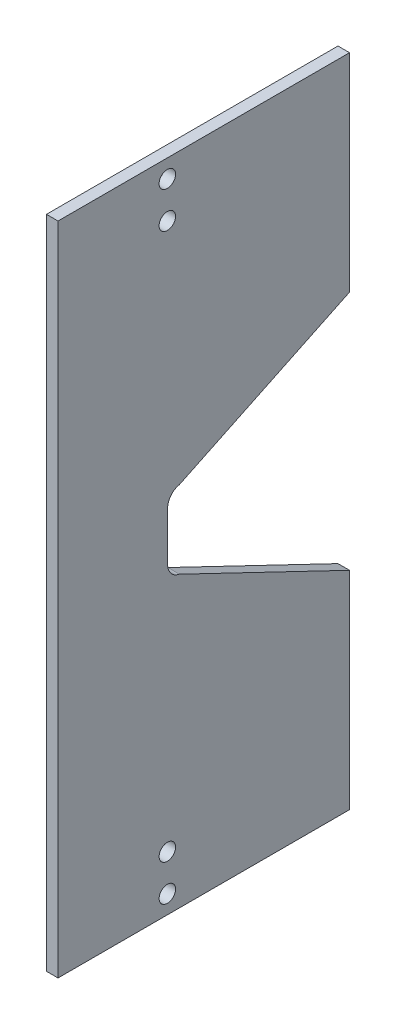
ISO-10303-21;
HEADER;
FILE_DESCRIPTION(('STEP AP214'),'2;1');
FILE_NAME('part.step','',(''),(''),'','','');
FILE_SCHEMA(('AUTOMOTIVE_DESIGN { 1 0 10303 214 1 1 1 1 }'));
ENDSEC;
DATA;
#1=APPLICATION_CONTEXT('core data for automotive mechanical design processes');
#2=APPLICATION_PROTOCOL_DEFINITION('international standard','automotive_design',2000,#1);
#3=PRODUCT_CONTEXT('',#1,'mechanical');
#4=PRODUCT('Part','Part','',(#3));
#5=PRODUCT_RELATED_PRODUCT_CATEGORY('part','',(#4));
#6=PRODUCT_DEFINITION_FORMATION('','',#4);
#7=PRODUCT_DEFINITION_CONTEXT('part definition',#1,'design');
#8=PRODUCT_DEFINITION('design','',#6,#7);
#9=PRODUCT_DEFINITION_SHAPE('','',#8);
#10=(LENGTH_UNIT() NAMED_UNIT(*) SI_UNIT(.MILLI.,.METRE.));
#11=(NAMED_UNIT(*) PLANE_ANGLE_UNIT() SI_UNIT($,.RADIAN.));
#12=(NAMED_UNIT(*) SI_UNIT($,.STERADIAN.) SOLID_ANGLE_UNIT());
#13=UNCERTAINTY_MEASURE_WITH_UNIT(LENGTH_MEASURE(1.E-05),#10,'distance_accuracy_value','');
#14=(GEOMETRIC_REPRESENTATION_CONTEXT(3) GLOBAL_UNCERTAINTY_ASSIGNED_CONTEXT((#13)) GLOBAL_UNIT_ASSIGNED_CONTEXT((#10,
#11,#12)) REPRESENTATION_CONTEXT('',''));
#15=CARTESIAN_POINT('',(0.,0.,0.));
#16=DIRECTION('',(0.,0.,1.));
#17=DIRECTION('',(1.,0.,0.));
#18=AXIS2_PLACEMENT_3D('',#15,#16,#17);
#19=CARTESIAN_POINT('',(0.794249999999998,-10.795,3.));
#20=DIRECTION('',(0.,1.,0.));
#21=DIRECTION('',(0.,0.,1.));
#22=AXIS2_PLACEMENT_3D('',#19,#20,#21);
#23=PLANE('',#22);
#24=DIRECTION('',(0.,0.,-1.));
#25=VECTOR('',#24,1.);
#26=CARTESIAN_POINT('',(-0.793750000000003,-10.795,3.));
#27=LINE('',#26,#25);
#28=CARTESIAN_POINT('',(-0.793750000000006,-10.795,15.));
#29=VERTEX_POINT('',#28);
#30=CARTESIAN_POINT('',(-0.793749999999994,-10.795,-25.));
#31=VERTEX_POINT('',#30);
#32=EDGE_CURVE('E181',#29,#31,#27,.T.);
#33=ORIENTED_EDGE('',*,*,#32,.F.);
#34=DIRECTION('',(-1.,0.,0.));
#35=VECTOR('',#34,1.);
#36=CARTESIAN_POINT('',(0.794249999999994,-10.795,15.));
#37=LINE('',#36,#35);
#38=CARTESIAN_POINT('',(0.794249999999994,-10.795,15.));
#39=VERTEX_POINT('',#38);
#40=EDGE_CURVE('E144',#39,#29,#37,.T.);
#41=ORIENTED_EDGE('',*,*,#40,.F.);
#42=DIRECTION('',(0.,0.,-1.));
#43=VECTOR('',#42,1.);
#44=CARTESIAN_POINT('',(0.794249999999998,-10.795,3.));
#45=LINE('',#44,#43);
#46=CARTESIAN_POINT('',(0.794250000000006,-10.795,-25.));
#47=VERTEX_POINT('',#46);
#48=EDGE_CURVE('E183',#39,#47,#45,.T.);
#49=ORIENTED_EDGE('',*,*,#48,.T.);
#50=DIRECTION('',(-1.,0.,0.));
#51=VECTOR('',#50,1.);
#52=CARTESIAN_POINT('',(0.794250000000006,-10.795,-25.));
#53=LINE('',#52,#51);
#54=EDGE_CURVE('E131',#47,#31,#53,.T.);
#55=ORIENTED_EDGE('',*,*,#54,.T.);
#56=EDGE_LOOP('',(#33,#41,#49,#55));
#57=FACE_BOUND('',#56,.T.);
#58=ADVANCED_FACE('F36',(#57),#23,.T.);
#59=CARTESIAN_POINT('',(0.794249999999998,-100.745,3.));
#60=DIRECTION('',(0.,-1.,0.));
#61=DIRECTION('',(0.,0.,-1.));
#62=AXIS2_PLACEMENT_3D('',#59,#60,#61);
#63=PLANE('',#62);
#64=DIRECTION('',(0.,0.,1.));
#65=VECTOR('',#64,1.);
#66=CARTESIAN_POINT('',(-0.793750000000003,-100.745,3.));
#67=LINE('',#66,#65);
#68=CARTESIAN_POINT('',(-0.793749999999994,-100.745,-25.));
#69=VERTEX_POINT('',#68);
#70=CARTESIAN_POINT('',(-0.793750000000006,-100.745,15.));
#71=VERTEX_POINT('',#70);
#72=EDGE_CURVE('E188',#69,#71,#67,.T.);
#73=ORIENTED_EDGE('',*,*,#72,.F.);
#74=DIRECTION('',(-1.,0.,0.));
#75=VECTOR('',#74,1.);
#76=CARTESIAN_POINT('',(0.794250000000006,-100.745,-25.));
#77=LINE('',#76,#75);
#78=CARTESIAN_POINT('',(0.794250000000006,-100.745,-25.));
#79=VERTEX_POINT('',#78);
#80=EDGE_CURVE('E136',#79,#69,#77,.T.);
#81=ORIENTED_EDGE('',*,*,#80,.F.);
#82=DIRECTION('',(0.,0.,1.));
#83=VECTOR('',#82,1.);
#84=CARTESIAN_POINT('',(0.794249999999998,-100.745,3.));
#85=LINE('',#84,#83);
#86=CARTESIAN_POINT('',(0.794249999999994,-100.745,15.));
#87=VERTEX_POINT('',#86);
#88=EDGE_CURVE('E180',#79,#87,#85,.T.);
#89=ORIENTED_EDGE('',*,*,#88,.T.);
#90=DIRECTION('',(-1.,0.,0.));
#91=VECTOR('',#90,1.);
#92=CARTESIAN_POINT('',(0.794249999999994,-100.745,15.));
#93=LINE('',#92,#91);
#94=EDGE_CURVE('E147',#87,#71,#93,.T.);
#95=ORIENTED_EDGE('',*,*,#94,.T.);
#96=EDGE_LOOP('',(#73,#81,#89,#95));
#97=FACE_BOUND('',#96,.T.);
#98=ADVANCED_FACE('F229',(#97),#63,.T.);
#99=CARTESIAN_POINT('',(0.794249999999999,-55.77,-0.0391447555514949));
#100=DIRECTION('',(0.,0.,-1.));
#101=DIRECTION('',(-1.,0.,0.));
#102=AXIS2_PLACEMENT_3D('',#99,#100,#101);
#103=PLANE('',#102);
#104=DIRECTION('',(0.,-1.,0.));
#105=VECTOR('',#104,1.);
#106=CARTESIAN_POINT('',(0.794249999999999,-55.77,-0.0391447555514949));
#107=LINE('',#106,#105);
#108=CARTESIAN_POINT('',(0.794249999999999,-52.4114543338415,-0.0391447555514953));
#109=VERTEX_POINT('',#108);
#110=CARTESIAN_POINT('',(0.794249999999999,-59.1285456661585,-0.0391447555514945));
#111=VERTEX_POINT('',#110);
#112=EDGE_CURVE('E177',#109,#111,#107,.T.);
#113=ORIENTED_EDGE('',*,*,#112,.T.);
#114=DIRECTION('',(-1.,0.,0.));
#115=VECTOR('',#114,1.);
#116=CARTESIAN_POINT('',(-0.793750000000002,-59.1285456661585,-0.0391447555514954));
#117=LINE('',#116,#115);
#118=CARTESIAN_POINT('',(-0.793750000000002,-59.1285456661585,-0.0391447555514954));
#119=VERTEX_POINT('',#118);
#120=EDGE_CURVE('E197',#111,#119,#117,.T.);
#121=ORIENTED_EDGE('',*,*,#120,.T.);
#122=DIRECTION('',(0.,-1.,0.));
#123=VECTOR('',#122,1.);
#124=CARTESIAN_POINT('',(-0.793750000000002,-55.77,-0.0391447555514954));
#125=LINE('',#124,#123);
#126=CARTESIAN_POINT('',(-0.793750000000002,-52.4114543338415,-0.0391447555514954));
#127=VERTEX_POINT('',#126);
#128=EDGE_CURVE('E174',#127,#119,#125,.T.);
#129=ORIENTED_EDGE('',*,*,#128,.F.);
#130=DIRECTION('',(-1.,0.,0.));
#131=VECTOR('',#130,1.);
#132=CARTESIAN_POINT('',(0.794249999999999,-52.4114543338415,-0.0391447555514949));
#133=LINE('',#132,#131);
#134=EDGE_CURVE('E192',#127,#109,#133,.F.);
#135=ORIENTED_EDGE('',*,*,#134,.T.);
#136=EDGE_LOOP('',(#113,#121,#129,#135));
#137=FACE_BOUND('',#136,.T.);
#138=ADVANCED_FACE('F241',(#137),#103,.T.);
#139=CARTESIAN_POINT('',(0.794250000000003,-12.795,-13.));
#140=DIRECTION('',(-1.,0.,0.));
#141=DIRECTION('',(0.,0.,1.));
#142=AXIS2_PLACEMENT_3D('',#139,#140,#141);
#143=PLANE('',#142);
#144=CARTESIAN_POINT('',(0.794249999999999,-52.4114543338415,-2.03914475555149));
#145=DIRECTION('',(-1.,0.,0.));
#146=DIRECTION('',(0.,0.,1.));
#147=AXIS2_PLACEMENT_3D('',#144,#145,#146);
#148=CIRCLE('',#147,2.);
#149=CARTESIAN_POINT('',(0.794249999999999,-50.4498612190227,-1.64907751532796));
#150=VERTEX_POINT('',#149);
#151=EDGE_CURVE('E124',#109,#150,#148,.T.);
#152=ORIENTED_EDGE('',*,*,#151,.T.);
#153=DIRECTION('',(0.,-0.432718299890711,0.901529185850182));
#154=VECTOR('',#153,1.);
#155=CARTESIAN_POINT('',(0.794249999999999,-50.4498612190227,-1.64907751532796));
#156=LINE('',#155,#154);
#157=CARTESIAN_POINT('',(0.794250000000006,-39.2418253206417,-25.));
#158=VERTEX_POINT('',#157);
#159=EDGE_CURVE('E111',#158,#150,#156,.T.);
#160=ORIENTED_EDGE('',*,*,#159,.F.);
#161=DIRECTION('',(0.,-1.,0.));
#162=VECTOR('',#161,1.);
#163=CARTESIAN_POINT('',(0.794250000000006,-10.795,-25.));
#164=LINE('',#163,#162);
#165=EDGE_CURVE('E121',#47,#158,#164,.T.);
#166=ORIENTED_EDGE('',*,*,#165,.F.);
#167=ORIENTED_EDGE('',*,*,#48,.F.);
#168=DIRECTION('',(0.,1.,0.));
#169=VECTOR('',#168,1.);
#170=CARTESIAN_POINT('',(0.794249999999994,-10.795,15.));
#171=LINE('',#170,#169);
#172=EDGE_CURVE('E141',#87,#39,#171,.T.);
#173=ORIENTED_EDGE('',*,*,#172,.F.);
#174=ORIENTED_EDGE('',*,*,#88,.F.);
#175=DIRECTION('',(0.,-1.,0.));
#176=VECTOR('',#175,1.);
#177=CARTESIAN_POINT('',(0.794250000000006,-65.7335226822871,-25.));
#178=LINE('',#177,#176);
#179=CARTESIAN_POINT('',(0.794250000000006,-72.2981746793583,-25.));
#180=VERTEX_POINT('',#179);
#181=EDGE_CURVE('E221',#180,#79,#178,.T.);
#182=ORIENTED_EDGE('',*,*,#181,.F.);
#183=DIRECTION('',(0.,-0.432718299890711,-0.901529185850182));
#184=VECTOR('',#183,1.);
#185=CARTESIAN_POINT('',(0.794249999999999,-61.0901387809773,-1.64907751532796));
#186=LINE('',#185,#184);
#187=CARTESIAN_POINT('',(0.794249999999999,-61.0901387809773,-1.64907751532796));
#188=VERTEX_POINT('',#187);
#189=EDGE_CURVE('E58',#188,#180,#186,.T.);
#190=ORIENTED_EDGE('',*,*,#189,.F.);
#191=CARTESIAN_POINT('',(0.794249999999999,-59.1285456661585,-2.03914475555149));
#192=DIRECTION('',(-1.,0.,0.));
#193=DIRECTION('',(0.,0.,1.));
#194=AXIS2_PLACEMENT_3D('',#191,#192,#193);
#195=CIRCLE('',#194,2.);
#196=EDGE_CURVE('E205',#188,#111,#195,.T.);
#197=ORIENTED_EDGE('',*,*,#196,.T.);
#198=ORIENTED_EDGE('',*,*,#112,.F.);
#199=EDGE_LOOP('',(#152,#160,#166,#167,#173,#174,#182,#190,#197,#198));
#200=FACE_BOUND('',#199,.T.);
#201=CARTESIAN_POINT('',(0.794249999999999,-93.245,0.));
#202=DIRECTION('',(-1.,0.,0.));
#203=DIRECTION('',(0.,0.,1.));
#204=AXIS2_PLACEMENT_3D('',#201,#202,#203);
#205=CIRCLE('',#204,1.1303);
#206=CARTESIAN_POINT('',(0.794249999999998,-93.245,1.1303));
#207=VERTEX_POINT('',#206);
#208=EDGE_CURVE('E153',#207,#207,#205,.T.);
#209=ORIENTED_EDGE('',*,*,#208,.T.);
#210=EDGE_LOOP('',(#209));
#211=FACE_BOUND('',#210,.T.);
#212=CARTESIAN_POINT('',(0.794249999999999,-98.245,0.));
#213=DIRECTION('',(-1.,0.,0.));
#214=DIRECTION('',(0.,0.,1.));
#215=AXIS2_PLACEMENT_3D('',#212,#213,#214);
#216=CIRCLE('',#215,1.1303);
#217=CARTESIAN_POINT('',(0.794249999999998,-98.245,1.1303));
#218=VERTEX_POINT('',#217);
#219=EDGE_CURVE('E159',#218,#218,#216,.T.);
#220=ORIENTED_EDGE('',*,*,#219,.T.);
#221=EDGE_LOOP('',(#220));
#222=FACE_BOUND('',#221,.T.);
#223=CARTESIAN_POINT('',(0.794249999999999,-13.295,0.));
#224=DIRECTION('',(-1.,0.,0.));
#225=DIRECTION('',(0.,0.,-1.));
#226=AXIS2_PLACEMENT_3D('',#223,#224,#225);
#227=CIRCLE('',#226,1.1303);
#228=CARTESIAN_POINT('',(0.794249999999999,-13.295,-1.1303));
#229=VERTEX_POINT('',#228);
#230=EDGE_CURVE('E165',#229,#229,#227,.T.);
#231=ORIENTED_EDGE('',*,*,#230,.T.);
#232=EDGE_LOOP('',(#231));
#233=FACE_BOUND('',#232,.T.);
#234=CARTESIAN_POINT('',(0.794249999999999,-18.295,0.));
#235=DIRECTION('',(-1.,0.,0.));
#236=DIRECTION('',(0.,0.,-1.));
#237=AXIS2_PLACEMENT_3D('',#234,#235,#236);
#238=CIRCLE('',#237,1.1303);
#239=CARTESIAN_POINT('',(0.794249999999999,-18.295,-1.1303));
#240=VERTEX_POINT('',#239);
#241=EDGE_CURVE('E171',#240,#240,#238,.T.);
#242=ORIENTED_EDGE('',*,*,#241,.T.);
#243=EDGE_LOOP('',(#242));
#244=FACE_BOUND('',#243,.T.);
#245=ADVANCED_FACE('F119',(#200,#211,#222,#233,#244),#143,.F.);
#246=CARTESIAN_POINT('',(-0.793749999999998,-12.795,-13.));
#247=DIRECTION('',(-1.,0.,0.));
#248=DIRECTION('',(0.,0.,1.));
#249=AXIS2_PLACEMENT_3D('',#246,#247,#248);
#250=PLANE('',#249);
#251=DIRECTION('',(0.,0.432718299890711,-0.901529185850183));
#252=VECTOR('',#251,1.);
#253=CARTESIAN_POINT('',(-0.793749999999994,-38.9710842723718,-25.5640643274959));
#254=LINE('',#253,#252);
#255=CARTESIAN_POINT('',(-0.793750000000001,-50.4498612190227,-1.64907751532796));
#256=VERTEX_POINT('',#255);
#257=CARTESIAN_POINT('',(-0.793749999999994,-39.2418253206417,-25.));
#258=VERTEX_POINT('',#257);
#259=EDGE_CURVE('E50',#256,#258,#254,.T.);
#260=ORIENTED_EDGE('',*,*,#259,.F.);
#261=CARTESIAN_POINT('',(-0.793750000000001,-52.4114543338415,-2.03914475555149));
#262=DIRECTION('',(-1.,0.,0.));
#263=DIRECTION('',(0.,0.,1.));
#264=AXIS2_PLACEMENT_3D('',#261,#262,#263);
#265=CIRCLE('',#264,2.);
#266=EDGE_CURVE('E194',#256,#127,#265,.F.);
#267=ORIENTED_EDGE('',*,*,#266,.T.);
#268=ORIENTED_EDGE('',*,*,#128,.T.);
#269=CARTESIAN_POINT('',(-0.793750000000001,-59.1285456661585,-2.03914475555149));
#270=DIRECTION('',(-1.,0.,0.));
#271=DIRECTION('',(0.,0.,1.));
#272=AXIS2_PLACEMENT_3D('',#269,#270,#271);
#273=CIRCLE('',#272,2.);
#274=CARTESIAN_POINT('',(-0.793750000000001,-61.0901387809773,-1.64907751532796));
#275=VERTEX_POINT('',#274);
#276=EDGE_CURVE('E202',#119,#275,#273,.F.);
#277=ORIENTED_EDGE('',*,*,#276,.T.);
#278=DIRECTION('',(0.,0.432718299890711,0.901529185850182));
#279=VECTOR('',#278,1.);
#280=CARTESIAN_POINT('',(-0.793750000000004,-56.4751970567948,7.96573345152746));
#281=LINE('',#280,#279);
#282=CARTESIAN_POINT('',(-0.793749999999994,-72.2981746793583,-25.));
#283=VERTEX_POINT('',#282);
#284=EDGE_CURVE('E126',#283,#275,#281,.T.);
#285=ORIENTED_EDGE('',*,*,#284,.F.);
#286=DIRECTION('',(0.,-1.,0.));
#287=VECTOR('',#286,1.);
#288=CARTESIAN_POINT('',(-0.793749999999994,-65.7335226822871,-25.));
#289=LINE('',#288,#287);
#290=EDGE_CURVE('E214',#283,#69,#289,.T.);
#291=ORIENTED_EDGE('',*,*,#290,.T.);
#292=ORIENTED_EDGE('',*,*,#72,.T.);
#293=DIRECTION('',(0.,1.,0.));
#294=VECTOR('',#293,1.);
#295=CARTESIAN_POINT('',(-0.793750000000006,-10.795,15.));
#296=LINE('',#295,#294);
#297=EDGE_CURVE('E134',#71,#29,#296,.T.);
#298=ORIENTED_EDGE('',*,*,#297,.T.);
#299=ORIENTED_EDGE('',*,*,#32,.T.);
#300=DIRECTION('',(0.,-1.,0.));
#301=VECTOR('',#300,1.);
#302=CARTESIAN_POINT('',(-0.793749999999994,-10.795,-25.));
#303=LINE('',#302,#301);
#304=EDGE_CURVE('E132',#31,#258,#303,.T.);
#305=ORIENTED_EDGE('',*,*,#304,.T.);
#306=EDGE_LOOP('',(#260,#267,#268,#277,#285,#291,#292,#298,#299,#305));
#307=FACE_BOUND('',#306,.T.);
#308=CARTESIAN_POINT('',(-0.793750000000002,-93.245,0.));
#309=DIRECTION('',(-1.,0.,0.));
#310=DIRECTION('',(0.,0.,1.));
#311=AXIS2_PLACEMENT_3D('',#308,#309,#310);
#312=CIRCLE('',#311,1.1303);
#313=CARTESIAN_POINT('',(-0.793750000000002,-93.245,1.1303));
#314=VERTEX_POINT('',#313);
#315=EDGE_CURVE('E150',#314,#314,#312,.T.);
#316=ORIENTED_EDGE('',*,*,#315,.F.);
#317=EDGE_LOOP('',(#316));
#318=FACE_BOUND('',#317,.T.);
#319=CARTESIAN_POINT('',(-0.793750000000002,-98.245,0.));
#320=DIRECTION('',(-1.,0.,0.));
#321=DIRECTION('',(0.,0.,1.));
#322=AXIS2_PLACEMENT_3D('',#319,#320,#321);
#323=CIRCLE('',#322,1.1303);
#324=CARTESIAN_POINT('',(-0.793750000000002,-98.245,1.1303));
#325=VERTEX_POINT('',#324);
#326=EDGE_CURVE('E156',#325,#325,#323,.T.);
#327=ORIENTED_EDGE('',*,*,#326,.F.);
#328=EDGE_LOOP('',(#327));
#329=FACE_BOUND('',#328,.T.);
#330=CARTESIAN_POINT('',(-0.793750000000002,-13.295,0.));
#331=DIRECTION('',(-1.,0.,0.));
#332=DIRECTION('',(0.,0.,-1.));
#333=AXIS2_PLACEMENT_3D('',#330,#331,#332);
#334=CIRCLE('',#333,1.1303);
#335=CARTESIAN_POINT('',(-0.793750000000001,-13.295,-1.1303));
#336=VERTEX_POINT('',#335);
#337=EDGE_CURVE('E162',#336,#336,#334,.T.);
#338=ORIENTED_EDGE('',*,*,#337,.F.);
#339=EDGE_LOOP('',(#338));
#340=FACE_BOUND('',#339,.T.);
#341=CARTESIAN_POINT('',(-0.793750000000002,-18.295,0.));
#342=DIRECTION('',(-1.,0.,0.));
#343=DIRECTION('',(0.,0.,-1.));
#344=AXIS2_PLACEMENT_3D('',#341,#342,#343);
#345=CIRCLE('',#344,1.1303);
#346=CARTESIAN_POINT('',(-0.793750000000001,-18.295,-1.1303));
#347=VERTEX_POINT('',#346);
#348=EDGE_CURVE('E168',#347,#347,#345,.T.);
#349=ORIENTED_EDGE('',*,*,#348,.F.);
#350=EDGE_LOOP('',(#349));
#351=FACE_BOUND('',#350,.T.);
#352=ADVANCED_FACE('F212',(#307,#318,#329,#340,#351),#250,.T.);
#353=CARTESIAN_POINT('',(0.794249999999999,-18.295,0.));
#354=DIRECTION('',(-1.,0.,0.));
#355=DIRECTION('',(0.,0.,1.));
#356=AXIS2_PLACEMENT_3D('',#353,#354,#355);
#357=CYLINDRICAL_SURFACE('',#356,1.1303);
#358=ORIENTED_EDGE('',*,*,#241,.F.);
#359=EDGE_LOOP('',(#358));
#360=FACE_BOUND('',#359,.T.);
#361=ORIENTED_EDGE('',*,*,#348,.T.);
#362=EDGE_LOOP('',(#361));
#363=FACE_BOUND('',#362,.T.);
#364=ADVANCED_FACE('F268',(#360,#363),#357,.F.);
#365=CARTESIAN_POINT('',(0.794249999999999,-13.295,0.));
#366=DIRECTION('',(-1.,0.,0.));
#367=DIRECTION('',(0.,0.,1.));
#368=AXIS2_PLACEMENT_3D('',#365,#366,#367);
#369=CYLINDRICAL_SURFACE('',#368,1.1303);
#370=ORIENTED_EDGE('',*,*,#230,.F.);
#371=EDGE_LOOP('',(#370));
#372=FACE_BOUND('',#371,.T.);
#373=ORIENTED_EDGE('',*,*,#337,.T.);
#374=EDGE_LOOP('',(#373));
#375=FACE_BOUND('',#374,.T.);
#376=ADVANCED_FACE('F272',(#372,#375),#369,.F.);
#377=CARTESIAN_POINT('',(0.794249999999999,-98.245,0.));
#378=DIRECTION('',(-1.,0.,0.));
#379=DIRECTION('',(0.,0.,1.));
#380=AXIS2_PLACEMENT_3D('',#377,#378,#379);
#381=CYLINDRICAL_SURFACE('',#380,1.1303);
#382=ORIENTED_EDGE('',*,*,#219,.F.);
#383=EDGE_LOOP('',(#382));
#384=FACE_BOUND('',#383,.T.);
#385=ORIENTED_EDGE('',*,*,#326,.T.);
#386=EDGE_LOOP('',(#385));
#387=FACE_BOUND('',#386,.T.);
#388=ADVANCED_FACE('F276',(#384,#387),#381,.F.);
#389=CARTESIAN_POINT('',(0.794249999999999,-93.245,0.));
#390=DIRECTION('',(-1.,0.,0.));
#391=DIRECTION('',(0.,0.,1.));
#392=AXIS2_PLACEMENT_3D('',#389,#390,#391);
#393=CYLINDRICAL_SURFACE('',#392,1.1303);
#394=ORIENTED_EDGE('',*,*,#208,.F.);
#395=EDGE_LOOP('',(#394));
#396=FACE_BOUND('',#395,.T.);
#397=ORIENTED_EDGE('',*,*,#315,.T.);
#398=EDGE_LOOP('',(#397));
#399=FACE_BOUND('',#398,.T.);
#400=ADVANCED_FACE('F251',(#396,#399),#393,.F.);
#401=CARTESIAN_POINT('',(0.794249999999999,-52.4114543338415,-2.03914475555149));
#402=DIRECTION('',(1.,0.,0.));
#403=DIRECTION('',(0.,0.,-1.));
#404=AXIS2_PLACEMENT_3D('',#401,#402,#403);
#405=CYLINDRICAL_SURFACE('',#404,2.);
#406=ORIENTED_EDGE('',*,*,#151,.F.);
#407=ORIENTED_EDGE('',*,*,#134,.F.);
#408=ORIENTED_EDGE('',*,*,#266,.F.);
#409=DIRECTION('',(-1.,0.,0.));
#410=VECTOR('',#409,1.);
#411=CARTESIAN_POINT('',(-0.793750000000001,-50.4498612190227,-1.64907751532796));
#412=LINE('',#411,#410);
#413=EDGE_CURVE('E185',#150,#256,#412,.T.);
#414=ORIENTED_EDGE('',*,*,#413,.F.);
#415=EDGE_LOOP('',(#406,#407,#408,#414));
#416=FACE_BOUND('',#415,.T.);
#417=ADVANCED_FACE('F239',(#416),#405,.F.);
#418=CARTESIAN_POINT('',(0.794249999999999,-59.1285456661585,-2.03914475555149));
#419=DIRECTION('',(1.,0.,0.));
#420=DIRECTION('',(0.,0.,-1.));
#421=AXIS2_PLACEMENT_3D('',#418,#419,#420);
#422=CYLINDRICAL_SURFACE('',#421,2.);
#423=ORIENTED_EDGE('',*,*,#196,.F.);
#424=DIRECTION('',(-1.,0.,0.));
#425=VECTOR('',#424,1.);
#426=CARTESIAN_POINT('',(0.794249999999999,-61.0901387809773,-1.64907751532796));
#427=LINE('',#426,#425);
#428=EDGE_CURVE('E200',#275,#188,#427,.F.);
#429=ORIENTED_EDGE('',*,*,#428,.F.);
#430=ORIENTED_EDGE('',*,*,#276,.F.);
#431=ORIENTED_EDGE('',*,*,#120,.F.);
#432=EDGE_LOOP('',(#423,#429,#430,#431));
#433=FACE_BOUND('',#432,.T.);
#434=ADVANCED_FACE('F38',(#433),#422,.F.);
#435=CARTESIAN_POINT('',(0.794249999999994,-10.795,15.));
#436=DIRECTION('',(0.,0.,1.));
#437=DIRECTION('',(1.,0.,0.));
#438=AXIS2_PLACEMENT_3D('',#435,#436,#437);
#439=PLANE('',#438);
#440=ORIENTED_EDGE('',*,*,#297,.F.);
#441=ORIENTED_EDGE('',*,*,#94,.F.);
#442=ORIENTED_EDGE('',*,*,#172,.T.);
#443=ORIENTED_EDGE('',*,*,#40,.T.);
#444=EDGE_LOOP('',(#440,#441,#442,#443));
#445=FACE_BOUND('',#444,.T.);
#446=ADVANCED_FACE('F232',(#445),#439,.T.);
#447=CARTESIAN_POINT('',(0.794250000000006,-10.795,-25.));
#448=DIRECTION('',(0.,0.,-1.));
#449=DIRECTION('',(-1.,0.,0.));
#450=AXIS2_PLACEMENT_3D('',#447,#448,#449);
#451=PLANE('',#450);
#452=DIRECTION('',(1.,0.,0.));
#453=VECTOR('',#452,1.);
#454=CARTESIAN_POINT('',(0.794250000000006,-39.2418253206417,-25.));
#455=LINE('',#454,#453);
#456=EDGE_CURVE('E11',#258,#158,#455,.T.);
#457=ORIENTED_EDGE('',*,*,#456,.F.);
#458=ORIENTED_EDGE('',*,*,#304,.F.);
#459=ORIENTED_EDGE('',*,*,#54,.F.);
#460=ORIENTED_EDGE('',*,*,#165,.T.);
#461=EDGE_LOOP('',(#457,#458,#459,#460));
#462=FACE_BOUND('',#461,.T.);
#463=ADVANCED_FACE('F129',(#462),#451,.T.);
#464=CARTESIAN_POINT('',(0.794250000000006,-65.7335226822871,-25.));
#465=DIRECTION('',(0.,0.,-1.));
#466=DIRECTION('',(-1.,0.,0.));
#467=AXIS2_PLACEMENT_3D('',#464,#465,#466);
#468=PLANE('',#467);
#469=DIRECTION('',(-1.,0.,0.));
#470=VECTOR('',#469,1.);
#471=CARTESIAN_POINT('',(0.794250000000006,-72.2981746793583,-25.));
#472=LINE('',#471,#470);
#473=EDGE_CURVE('E44',#180,#283,#472,.T.);
#474=ORIENTED_EDGE('',*,*,#473,.F.);
#475=ORIENTED_EDGE('',*,*,#181,.T.);
#476=ORIENTED_EDGE('',*,*,#80,.T.);
#477=ORIENTED_EDGE('',*,*,#290,.F.);
#478=EDGE_LOOP('',(#474,#475,#476,#477));
#479=FACE_BOUND('',#478,.T.);
#480=ADVANCED_FACE('F219',(#479),#468,.T.);
#481=CARTESIAN_POINT('',(-9.20575,-61.0901387809773,-1.64907751532796));
#482=DIRECTION('',(0.,-0.901529185850182,0.432718299890711));
#483=DIRECTION('',(0.,-0.432718299890711,-0.901529185850182));
#484=AXIS2_PLACEMENT_3D('',#481,#482,#483);
#485=PLANE('',#484);
#486=ORIENTED_EDGE('',*,*,#284,.T.);
#487=ORIENTED_EDGE('',*,*,#428,.T.);
#488=ORIENTED_EDGE('',*,*,#189,.T.);
#489=ORIENTED_EDGE('',*,*,#473,.T.);
#490=EDGE_LOOP('',(#486,#487,#488,#489));
#491=FACE_BOUND('',#490,.T.);
#492=ADVANCED_FACE('F207',(#491),#485,.F.);
#493=CARTESIAN_POINT('',(-9.20575,-50.4498612190227,-1.64907751532796));
#494=DIRECTION('',(0.,0.901529185850182,0.432718299890711));
#495=DIRECTION('',(0.,-0.432718299890711,0.901529185850183));
#496=AXIS2_PLACEMENT_3D('',#493,#494,#495);
#497=PLANE('',#496);
#498=ORIENTED_EDGE('',*,*,#259,.T.);
#499=ORIENTED_EDGE('',*,*,#456,.T.);
#500=ORIENTED_EDGE('',*,*,#159,.T.);
#501=ORIENTED_EDGE('',*,*,#413,.T.);
#502=EDGE_LOOP('',(#498,#499,#500,#501));
#503=FACE_BOUND('',#502,.T.);
#504=ADVANCED_FACE('F110',(#503),#497,.F.);
#505=CLOSED_SHELL('',(#58,#98,#138,#245,#352,#364,#376,#388,#400,#417,#434,#446,#463,#480,#492,#504));
#506=MANIFOLD_SOLID_BREP('B2',#505);
#507=ADVANCED_BREP_SHAPE_REPRESENTATION('',(#18,#506),#14);
#508=SHAPE_DEFINITION_REPRESENTATION(#9,#507);
ENDSEC;
END-ISO-10303-21;
